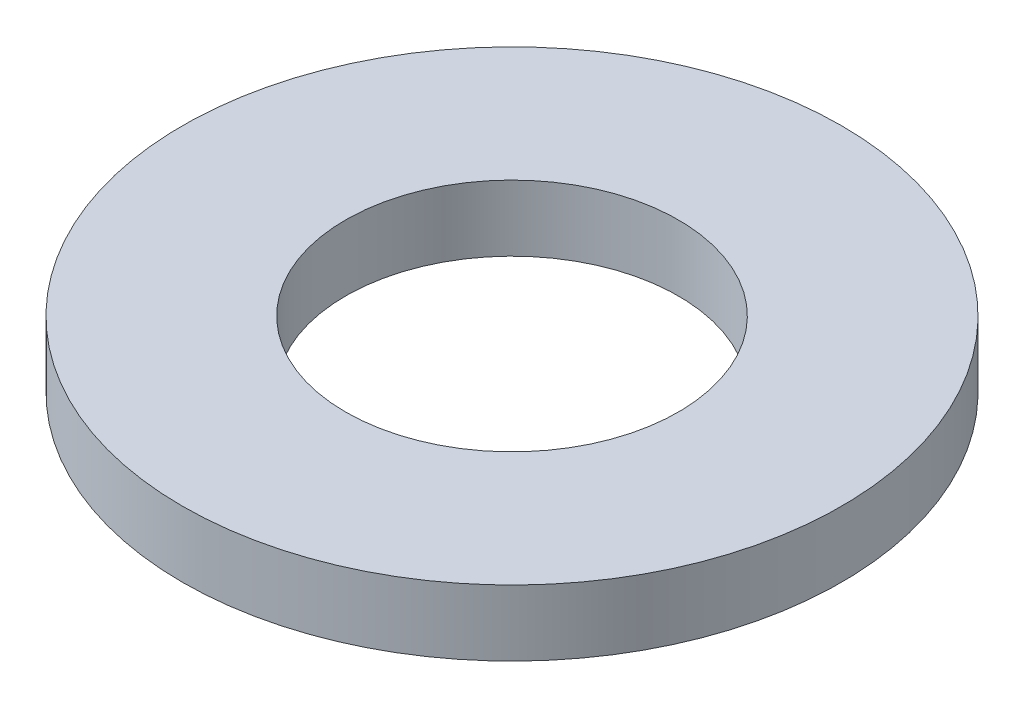
ISO-10303-21;
HEADER;
FILE_DESCRIPTION(('STEP AP214'),'2;1');
FILE_NAME('part.step','',(''),(''),'','','');
FILE_SCHEMA(('AUTOMOTIVE_DESIGN { 1 0 10303 214 1 1 1 1 }'));
ENDSEC;
DATA;
#1=APPLICATION_CONTEXT('core data for automotive mechanical design processes');
#2=APPLICATION_PROTOCOL_DEFINITION('international standard','automotive_design',2000,#1);
#3=PRODUCT_CONTEXT('',#1,'mechanical');
#4=PRODUCT('Part','Part','',(#3));
#5=PRODUCT_RELATED_PRODUCT_CATEGORY('part','',(#4));
#6=PRODUCT_DEFINITION_FORMATION('','',#4);
#7=PRODUCT_DEFINITION_CONTEXT('part definition',#1,'design');
#8=PRODUCT_DEFINITION('design','',#6,#7);
#9=PRODUCT_DEFINITION_SHAPE('','',#8);
#10=(LENGTH_UNIT() NAMED_UNIT(*) SI_UNIT(.MILLI.,.METRE.));
#11=(NAMED_UNIT(*) PLANE_ANGLE_UNIT() SI_UNIT($,.RADIAN.));
#12=(NAMED_UNIT(*) SI_UNIT($,.STERADIAN.) SOLID_ANGLE_UNIT());
#13=UNCERTAINTY_MEASURE_WITH_UNIT(LENGTH_MEASURE(1.E-05),#10,'distance_accuracy_value','');
#14=(GEOMETRIC_REPRESENTATION_CONTEXT(3) GLOBAL_UNCERTAINTY_ASSIGNED_CONTEXT((#13)) GLOBAL_UNIT_ASSIGNED_CONTEXT((#10,
#11,#12)) REPRESENTATION_CONTEXT('',''));
#15=CARTESIAN_POINT('',(0.,0.,0.));
#16=DIRECTION('',(0.,0.,1.));
#17=DIRECTION('',(1.,0.,0.));
#18=AXIS2_PLACEMENT_3D('',#15,#16,#17);
#19=CARTESIAN_POINT('',(0.,1.,0.));
#20=DIRECTION('',(0.,1.,0.));
#21=DIRECTION('',(0.,0.,1.));
#22=AXIS2_PLACEMENT_3D('',#19,#20,#21);
#23=PLANE('',#22);
#24=CARTESIAN_POINT('',(0.,1.,0.));
#25=DIRECTION('',(0.,1.,0.));
#26=DIRECTION('',(0.,0.,1.));
#27=AXIS2_PLACEMENT_3D('',#24,#25,#26);
#28=CIRCLE('',#27,5.);
#29=CARTESIAN_POINT('',(0.,1.,5.));
#30=VERTEX_POINT('',#29);
#31=EDGE_CURVE('E10',#30,#30,#28,.T.);
#32=ORIENTED_EDGE('',*,*,#31,.T.);
#33=EDGE_LOOP('',(#32));
#34=FACE_BOUND('',#33,.T.);
#35=CARTESIAN_POINT('',(0.,1.,0.));
#36=DIRECTION('',(0.,1.,0.));
#37=DIRECTION('',(0.,0.,1.));
#38=AXIS2_PLACEMENT_3D('',#35,#36,#37);
#39=CIRCLE('',#38,2.525);
#40=CARTESIAN_POINT('',(0.,1.,2.525));
#41=VERTEX_POINT('',#40);
#42=EDGE_CURVE('E43',#41,#41,#39,.T.);
#43=ORIENTED_EDGE('',*,*,#42,.F.);
#44=EDGE_LOOP('',(#43));
#45=FACE_BOUND('',#44,.T.);
#46=ADVANCED_FACE('F32',(#34,#45),#23,.T.);
#47=CARTESIAN_POINT('',(0.,0.,0.));
#48=DIRECTION('',(0.,1.,0.));
#49=DIRECTION('',(0.,0.,1.));
#50=AXIS2_PLACEMENT_3D('',#47,#48,#49);
#51=PLANE('',#50);
#52=CARTESIAN_POINT('',(0.,0.,0.));
#53=DIRECTION('',(0.,1.,0.));
#54=DIRECTION('',(0.,0.,1.));
#55=AXIS2_PLACEMENT_3D('',#52,#53,#54);
#56=CIRCLE('',#55,5.);
#57=CARTESIAN_POINT('',(0.,0.,5.));
#58=VERTEX_POINT('',#57);
#59=EDGE_CURVE('E36',#58,#58,#56,.T.);
#60=ORIENTED_EDGE('',*,*,#59,.F.);
#61=EDGE_LOOP('',(#60));
#62=FACE_BOUND('',#61,.T.);
#63=CARTESIAN_POINT('',(0.,0.,0.));
#64=DIRECTION('',(0.,1.,0.));
#65=DIRECTION('',(0.,0.,1.));
#66=AXIS2_PLACEMENT_3D('',#63,#64,#65);
#67=CIRCLE('',#66,2.525);
#68=CARTESIAN_POINT('',(0.,0.,2.525));
#69=VERTEX_POINT('',#68);
#70=EDGE_CURVE('E45',#69,#69,#67,.T.);
#71=ORIENTED_EDGE('',*,*,#70,.T.);
#72=EDGE_LOOP('',(#71));
#73=FACE_BOUND('',#72,.T.);
#74=ADVANCED_FACE('F55',(#62,#73),#51,.F.);
#75=CARTESIAN_POINT('',(0.,1.,0.));
#76=DIRECTION('',(0.,-1.,0.));
#77=DIRECTION('',(0.,0.,-1.));
#78=AXIS2_PLACEMENT_3D('',#75,#76,#77);
#79=CYLINDRICAL_SURFACE('',#78,5.);
#80=ORIENTED_EDGE('',*,*,#31,.F.);
#81=EDGE_LOOP('',(#80));
#82=FACE_BOUND('',#81,.T.);
#83=ORIENTED_EDGE('',*,*,#59,.T.);
#84=EDGE_LOOP('',(#83));
#85=FACE_BOUND('',#84,.T.);
#86=ADVANCED_FACE('F34',(#82,#85),#79,.T.);
#87=CARTESIAN_POINT('',(0.,1.,0.));
#88=DIRECTION('',(0.,-1.,0.));
#89=DIRECTION('',(0.,0.,-1.));
#90=AXIS2_PLACEMENT_3D('',#87,#88,#89);
#91=CYLINDRICAL_SURFACE('',#90,2.525);
#92=ORIENTED_EDGE('',*,*,#42,.T.);
#93=EDGE_LOOP('',(#92));
#94=FACE_BOUND('',#93,.T.);
#95=ORIENTED_EDGE('',*,*,#70,.F.);
#96=EDGE_LOOP('',(#95));
#97=FACE_BOUND('',#96,.T.);
#98=ADVANCED_FACE('F51',(#94,#97),#91,.F.);
#99=CLOSED_SHELL('',(#46,#74,#86,#98));
#100=MANIFOLD_SOLID_BREP('B2',#99);
#101=ADVANCED_BREP_SHAPE_REPRESENTATION('',(#18,#100),#14);
#102=SHAPE_DEFINITION_REPRESENTATION(#9,#101);
ENDSEC;
END-ISO-10303-21;
